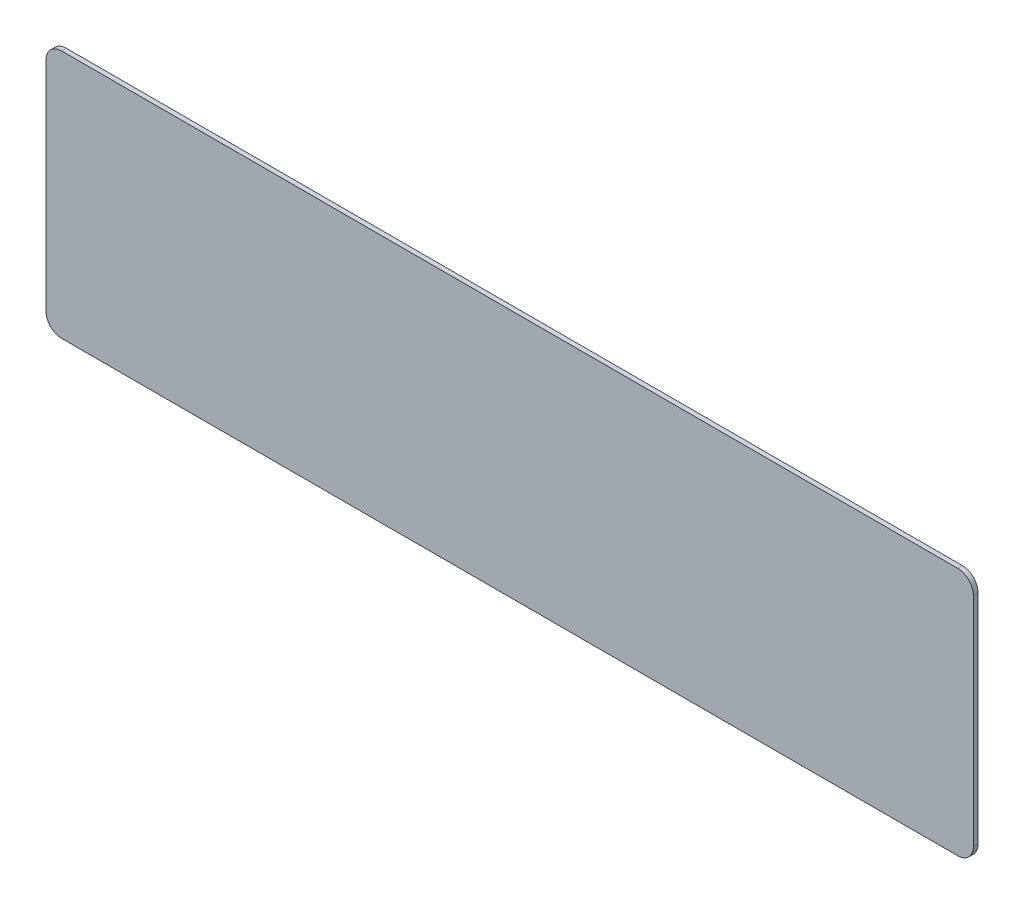
ISO-10303-21;
HEADER;
FILE_DESCRIPTION(('STEP AP214'),'2;1');
FILE_NAME('part.step','',(''),(''),'','','');
FILE_SCHEMA(('AUTOMOTIVE_DESIGN { 1 0 10303 214 1 1 1 1 }'));
ENDSEC;
DATA;
#1=APPLICATION_CONTEXT('core data for automotive mechanical design processes');
#2=APPLICATION_PROTOCOL_DEFINITION('international standard','automotive_design',2000,#1);
#3=PRODUCT_CONTEXT('',#1,'mechanical');
#4=PRODUCT('Part','Part','',(#3));
#5=PRODUCT_RELATED_PRODUCT_CATEGORY('part','',(#4));
#6=PRODUCT_DEFINITION_FORMATION('','',#4);
#7=PRODUCT_DEFINITION_CONTEXT('part definition',#1,'design');
#8=PRODUCT_DEFINITION('design','',#6,#7);
#9=PRODUCT_DEFINITION_SHAPE('','',#8);
#10=(LENGTH_UNIT() NAMED_UNIT(*) SI_UNIT(.MILLI.,.METRE.));
#11=(NAMED_UNIT(*) PLANE_ANGLE_UNIT() SI_UNIT($,.RADIAN.));
#12=(NAMED_UNIT(*) SI_UNIT($,.STERADIAN.) SOLID_ANGLE_UNIT());
#13=UNCERTAINTY_MEASURE_WITH_UNIT(LENGTH_MEASURE(1.E-05),#10,'distance_accuracy_value','');
#14=(GEOMETRIC_REPRESENTATION_CONTEXT(3) GLOBAL_UNCERTAINTY_ASSIGNED_CONTEXT((#13)) GLOBAL_UNIT_ASSIGNED_CONTEXT((#10,
#11,#12)) REPRESENTATION_CONTEXT('',''));
#15=CARTESIAN_POINT('',(0.,0.,0.));
#16=DIRECTION('',(0.,0.,1.));
#17=DIRECTION('',(1.,0.,0.));
#18=AXIS2_PLACEMENT_3D('',#15,#16,#17);
#19=CARTESIAN_POINT('',(5.,75.,1.5));
#20=DIRECTION('',(0.,0.,-1.));
#21=DIRECTION('',(-1.,0.,0.));
#22=AXIS2_PLACEMENT_3D('',#19,#20,#21);
#23=CYLINDRICAL_SURFACE('',#22,5.);
#24=CARTESIAN_POINT('',(5.,75.,0.));
#25=DIRECTION('',(0.,0.,1.));
#26=DIRECTION('',(1.,0.,0.));
#27=AXIS2_PLACEMENT_3D('',#24,#25,#26);
#28=CIRCLE('',#27,5.);
#29=CARTESIAN_POINT('',(5.00000000000004,80.,0.));
#30=VERTEX_POINT('',#29);
#31=CARTESIAN_POINT('',(0.,75.,0.));
#32=VERTEX_POINT('',#31);
#33=EDGE_CURVE('E129',#30,#32,#28,.T.);
#34=ORIENTED_EDGE('',*,*,#33,.T.);
#35=DIRECTION('',(0.,0.,-1.));
#36=VECTOR('',#35,1.);
#37=CARTESIAN_POINT('',(0.,75.,1.5));
#38=LINE('',#37,#36);
#39=CARTESIAN_POINT('',(0.,75.,1.5));
#40=VERTEX_POINT('',#39);
#41=EDGE_CURVE('E11',#40,#32,#38,.T.);
#42=ORIENTED_EDGE('',*,*,#41,.F.);
#43=CARTESIAN_POINT('',(5.,75.,1.5));
#44=DIRECTION('',(0.,0.,1.));
#45=DIRECTION('',(1.,0.,0.));
#46=AXIS2_PLACEMENT_3D('',#43,#44,#45);
#47=CIRCLE('',#46,5.);
#48=CARTESIAN_POINT('',(5.00000000000004,80.,1.5));
#49=VERTEX_POINT('',#48);
#50=EDGE_CURVE('E143',#49,#40,#47,.T.);
#51=ORIENTED_EDGE('',*,*,#50,.F.);
#52=DIRECTION('',(0.,0.,-1.));
#53=VECTOR('',#52,1.);
#54=CARTESIAN_POINT('',(5.00000000000004,80.,1.5));
#55=LINE('',#54,#53);
#56=EDGE_CURVE('E125',#49,#30,#55,.T.);
#57=ORIENTED_EDGE('',*,*,#56,.T.);
#58=EDGE_LOOP('',(#34,#42,#51,#57));
#59=FACE_BOUND('',#58,.T.);
#60=ADVANCED_FACE('F33',(#59),#23,.T.);
#61=CARTESIAN_POINT('',(0.,5.00000000000004,1.5));
#62=DIRECTION('',(1.,0.,0.));
#63=DIRECTION('',(0.,0.,-1.));
#64=AXIS2_PLACEMENT_3D('',#61,#62,#63);
#65=PLANE('',#64);
#66=DIRECTION('',(0.,-1.,0.));
#67=VECTOR('',#66,1.);
#68=CARTESIAN_POINT('',(0.,5.00000000000004,0.));
#69=LINE('',#68,#67);
#70=CARTESIAN_POINT('',(0.,5.,0.));
#71=VERTEX_POINT('',#70);
#72=EDGE_CURVE('E132',#32,#71,#69,.T.);
#73=ORIENTED_EDGE('',*,*,#72,.T.);
#74=DIRECTION('',(0.,0.,-1.));
#75=VECTOR('',#74,1.);
#76=CARTESIAN_POINT('',(0.,5.,1.5));
#77=LINE('',#76,#75);
#78=CARTESIAN_POINT('',(0.,5.,1.5));
#79=VERTEX_POINT('',#78);
#80=EDGE_CURVE('E41',#79,#71,#77,.T.);
#81=ORIENTED_EDGE('',*,*,#80,.F.);
#82=DIRECTION('',(0.,-1.,0.));
#83=VECTOR('',#82,1.);
#84=CARTESIAN_POINT('',(0.,5.00000000000004,1.5));
#85=LINE('',#84,#83);
#86=EDGE_CURVE('E92',#40,#79,#85,.T.);
#87=ORIENTED_EDGE('',*,*,#86,.F.);
#88=ORIENTED_EDGE('',*,*,#41,.T.);
#89=EDGE_LOOP('',(#73,#81,#87,#88));
#90=FACE_BOUND('',#89,.T.);
#91=ADVANCED_FACE('F178',(#90),#65,.F.);
#92=CARTESIAN_POINT('',(5.,5.,1.5));
#93=DIRECTION('',(0.,0.,-1.));
#94=DIRECTION('',(-1.,0.,0.));
#95=AXIS2_PLACEMENT_3D('',#92,#93,#94);
#96=CYLINDRICAL_SURFACE('',#95,5.);
#97=CARTESIAN_POINT('',(5.,5.,0.));
#98=DIRECTION('',(0.,0.,1.));
#99=DIRECTION('',(-1.,0.,0.));
#100=AXIS2_PLACEMENT_3D('',#97,#98,#99);
#101=CIRCLE('',#100,5.);
#102=CARTESIAN_POINT('',(5.00000000000004,0.,0.));
#103=VERTEX_POINT('',#102);
#104=EDGE_CURVE('E134',#71,#103,#101,.T.);
#105=ORIENTED_EDGE('',*,*,#104,.T.);
#106=DIRECTION('',(0.,0.,-1.));
#107=VECTOR('',#106,1.);
#108=CARTESIAN_POINT('',(5.00000000000004,0.,1.5));
#109=LINE('',#108,#107);
#110=CARTESIAN_POINT('',(5.00000000000004,0.,1.5));
#111=VERTEX_POINT('',#110);
#112=EDGE_CURVE('E150',#111,#103,#109,.T.);
#113=ORIENTED_EDGE('',*,*,#112,.F.);
#114=CARTESIAN_POINT('',(5.,5.,1.5));
#115=DIRECTION('',(0.,0.,1.));
#116=DIRECTION('',(-1.,0.,0.));
#117=AXIS2_PLACEMENT_3D('',#114,#115,#116);
#118=CIRCLE('',#117,5.);
#119=EDGE_CURVE('E158',#79,#111,#118,.T.);
#120=ORIENTED_EDGE('',*,*,#119,.F.);
#121=ORIENTED_EDGE('',*,*,#80,.T.);
#122=EDGE_LOOP('',(#105,#113,#120,#121));
#123=FACE_BOUND('',#122,.T.);
#124=ADVANCED_FACE('F156',(#123),#96,.T.);
#125=CARTESIAN_POINT('',(5.00000000000004,0.,1.5));
#126=DIRECTION('',(0.,1.,0.));
#127=DIRECTION('',(0.,0.,1.));
#128=AXIS2_PLACEMENT_3D('',#125,#126,#127);
#129=PLANE('',#128);
#130=DIRECTION('',(1.,0.,0.));
#131=VECTOR('',#130,1.);
#132=CARTESIAN_POINT('',(5.00000000000004,0.,0.));
#133=LINE('',#132,#131);
#134=CARTESIAN_POINT('',(293.,0.,0.));
#135=VERTEX_POINT('',#134);
#136=EDGE_CURVE('E136',#103,#135,#133,.T.);
#137=ORIENTED_EDGE('',*,*,#136,.T.);
#138=DIRECTION('',(0.,0.,-1.));
#139=VECTOR('',#138,1.);
#140=CARTESIAN_POINT('',(293.,0.,1.5));
#141=LINE('',#140,#139);
#142=CARTESIAN_POINT('',(293.,0.,1.5));
#143=VERTEX_POINT('',#142);
#144=EDGE_CURVE('E147',#143,#135,#141,.T.);
#145=ORIENTED_EDGE('',*,*,#144,.F.);
#146=DIRECTION('',(1.,0.,0.));
#147=VECTOR('',#146,1.);
#148=CARTESIAN_POINT('',(5.00000000000004,0.,1.5));
#149=LINE('',#148,#147);
#150=EDGE_CURVE('E170',#111,#143,#149,.T.);
#151=ORIENTED_EDGE('',*,*,#150,.F.);
#152=ORIENTED_EDGE('',*,*,#112,.T.);
#153=EDGE_LOOP('',(#137,#145,#151,#152));
#154=FACE_BOUND('',#153,.T.);
#155=ADVANCED_FACE('F166',(#154),#129,.F.);
#156=CARTESIAN_POINT('',(293.,5.,1.5));
#157=DIRECTION('',(0.,0.,-1.));
#158=DIRECTION('',(-1.,0.,0.));
#159=AXIS2_PLACEMENT_3D('',#156,#157,#158);
#160=CYLINDRICAL_SURFACE('',#159,5.);
#161=CARTESIAN_POINT('',(293.,5.,0.));
#162=DIRECTION('',(0.,0.,1.));
#163=DIRECTION('',(1.,0.,0.));
#164=AXIS2_PLACEMENT_3D('',#161,#162,#163);
#165=CIRCLE('',#164,5.);
#166=CARTESIAN_POINT('',(298.,5.,0.));
#167=VERTEX_POINT('',#166);
#168=EDGE_CURVE('E138',#135,#167,#165,.T.);
#169=ORIENTED_EDGE('',*,*,#168,.T.);
#170=DIRECTION('',(0.,0.,-1.));
#171=VECTOR('',#170,1.);
#172=CARTESIAN_POINT('',(298.,5.,1.5));
#173=LINE('',#172,#171);
#174=CARTESIAN_POINT('',(298.,5.,1.5));
#175=VERTEX_POINT('',#174);
#176=EDGE_CURVE('E120',#175,#167,#173,.T.);
#177=ORIENTED_EDGE('',*,*,#176,.F.);
#178=CARTESIAN_POINT('',(293.,5.,1.5));
#179=DIRECTION('',(0.,0.,1.));
#180=DIRECTION('',(1.,0.,0.));
#181=AXIS2_PLACEMENT_3D('',#178,#179,#180);
#182=CIRCLE('',#181,5.);
#183=EDGE_CURVE('E111',#143,#175,#182,.T.);
#184=ORIENTED_EDGE('',*,*,#183,.F.);
#185=ORIENTED_EDGE('',*,*,#144,.T.);
#186=EDGE_LOOP('',(#169,#177,#184,#185));
#187=FACE_BOUND('',#186,.T.);
#188=ADVANCED_FACE('F169',(#187),#160,.T.);
#189=CARTESIAN_POINT('',(298.,5.,1.5));
#190=DIRECTION('',(-1.,0.,0.));
#191=DIRECTION('',(0.,0.,1.));
#192=AXIS2_PLACEMENT_3D('',#189,#190,#191);
#193=PLANE('',#192);
#194=DIRECTION('',(0.,1.,0.));
#195=VECTOR('',#194,1.);
#196=CARTESIAN_POINT('',(298.,5.,0.));
#197=LINE('',#196,#195);
#198=CARTESIAN_POINT('',(298.,75.,0.));
#199=VERTEX_POINT('',#198);
#200=EDGE_CURVE('E119',#167,#199,#197,.T.);
#201=ORIENTED_EDGE('',*,*,#200,.T.);
#202=DIRECTION('',(0.,0.,-1.));
#203=VECTOR('',#202,1.);
#204=CARTESIAN_POINT('',(298.,75.,1.5));
#205=LINE('',#204,#203);
#206=CARTESIAN_POINT('',(298.,75.,1.5));
#207=VERTEX_POINT('',#206);
#208=EDGE_CURVE('E116',#207,#199,#205,.T.);
#209=ORIENTED_EDGE('',*,*,#208,.F.);
#210=DIRECTION('',(0.,1.,0.));
#211=VECTOR('',#210,1.);
#212=CARTESIAN_POINT('',(298.,5.,1.5));
#213=LINE('',#212,#211);
#214=EDGE_CURVE('E105',#175,#207,#213,.T.);
#215=ORIENTED_EDGE('',*,*,#214,.F.);
#216=ORIENTED_EDGE('',*,*,#176,.T.);
#217=EDGE_LOOP('',(#201,#209,#215,#216));
#218=FACE_BOUND('',#217,.T.);
#219=ADVANCED_FACE('F117',(#218),#193,.F.);
#220=CARTESIAN_POINT('',(293.,75.,1.5));
#221=DIRECTION('',(0.,0.,-1.));
#222=DIRECTION('',(-1.,0.,0.));
#223=AXIS2_PLACEMENT_3D('',#220,#221,#222);
#224=CYLINDRICAL_SURFACE('',#223,5.);
#225=CARTESIAN_POINT('',(293.,75.,0.));
#226=DIRECTION('',(0.,0.,1.));
#227=DIRECTION('',(1.,0.,0.));
#228=AXIS2_PLACEMENT_3D('',#225,#226,#227);
#229=CIRCLE('',#228,5.);
#230=CARTESIAN_POINT('',(293.,80.,0.));
#231=VERTEX_POINT('',#230);
#232=EDGE_CURVE('E78',#199,#231,#229,.T.);
#233=ORIENTED_EDGE('',*,*,#232,.T.);
#234=DIRECTION('',(0.,0.,-1.));
#235=VECTOR('',#234,1.);
#236=CARTESIAN_POINT('',(293.,80.,1.5));
#237=LINE('',#236,#235);
#238=CARTESIAN_POINT('',(293.,80.,1.5));
#239=VERTEX_POINT('',#238);
#240=EDGE_CURVE('E121',#239,#231,#237,.T.);
#241=ORIENTED_EDGE('',*,*,#240,.F.);
#242=CARTESIAN_POINT('',(293.,75.,1.5));
#243=DIRECTION('',(0.,0.,1.));
#244=DIRECTION('',(1.,0.,0.));
#245=AXIS2_PLACEMENT_3D('',#242,#243,#244);
#246=CIRCLE('',#245,5.);
#247=EDGE_CURVE('E109',#207,#239,#246,.T.);
#248=ORIENTED_EDGE('',*,*,#247,.F.);
#249=ORIENTED_EDGE('',*,*,#208,.T.);
#250=EDGE_LOOP('',(#233,#241,#248,#249));
#251=FACE_BOUND('',#250,.T.);
#252=ADVANCED_FACE('F123',(#251),#224,.T.);
#253=CARTESIAN_POINT('',(5.00000000000004,80.,1.5));
#254=DIRECTION('',(0.,-1.,0.));
#255=DIRECTION('',(0.,0.,-1.));
#256=AXIS2_PLACEMENT_3D('',#253,#254,#255);
#257=PLANE('',#256);
#258=DIRECTION('',(-1.,0.,0.));
#259=VECTOR('',#258,1.);
#260=CARTESIAN_POINT('',(5.00000000000004,80.,0.));
#261=LINE('',#260,#259);
#262=EDGE_CURVE('E84',#231,#30,#261,.T.);
#263=ORIENTED_EDGE('',*,*,#262,.T.);
#264=ORIENTED_EDGE('',*,*,#56,.F.);
#265=DIRECTION('',(-1.,0.,0.));
#266=VECTOR('',#265,1.);
#267=CARTESIAN_POINT('',(5.00000000000004,80.,1.5));
#268=LINE('',#267,#266);
#269=EDGE_CURVE('E49',#239,#49,#268,.T.);
#270=ORIENTED_EDGE('',*,*,#269,.F.);
#271=ORIENTED_EDGE('',*,*,#240,.T.);
#272=EDGE_LOOP('',(#263,#264,#270,#271));
#273=FACE_BOUND('',#272,.T.);
#274=ADVANCED_FACE('F194',(#273),#257,.F.);
#275=CARTESIAN_POINT('',(5.,75.,1.5));
#276=DIRECTION('',(0.,0.,1.));
#277=DIRECTION('',(1.,0.,0.));
#278=AXIS2_PLACEMENT_3D('',#275,#276,#277);
#279=PLANE('',#278);
#280=ORIENTED_EDGE('',*,*,#50,.T.);
#281=ORIENTED_EDGE('',*,*,#86,.T.);
#282=ORIENTED_EDGE('',*,*,#119,.T.);
#283=ORIENTED_EDGE('',*,*,#150,.T.);
#284=ORIENTED_EDGE('',*,*,#183,.T.);
#285=ORIENTED_EDGE('',*,*,#214,.T.);
#286=ORIENTED_EDGE('',*,*,#247,.T.);
#287=ORIENTED_EDGE('',*,*,#269,.T.);
#288=EDGE_LOOP('',(#280,#281,#282,#283,#284,#285,#286,#287));
#289=FACE_BOUND('',#288,.T.);
#290=ADVANCED_FACE('F107',(#289),#279,.T.);
#291=CARTESIAN_POINT('',(5.,75.,0.));
#292=DIRECTION('',(0.,0.,1.));
#293=DIRECTION('',(1.,0.,0.));
#294=AXIS2_PLACEMENT_3D('',#291,#292,#293);
#295=PLANE('',#294);
#296=ORIENTED_EDGE('',*,*,#33,.F.);
#297=ORIENTED_EDGE('',*,*,#262,.F.);
#298=ORIENTED_EDGE('',*,*,#232,.F.);
#299=ORIENTED_EDGE('',*,*,#200,.F.);
#300=ORIENTED_EDGE('',*,*,#168,.F.);
#301=ORIENTED_EDGE('',*,*,#136,.F.);
#302=ORIENTED_EDGE('',*,*,#104,.F.);
#303=ORIENTED_EDGE('',*,*,#72,.F.);
#304=EDGE_LOOP('',(#296,#297,#298,#299,#300,#301,#302,#303));
#305=FACE_BOUND('',#304,.T.);
#306=ADVANCED_FACE('F162',(#305),#295,.F.);
#307=CLOSED_SHELL('',(#60,#91,#124,#155,#188,#219,#252,#274,#290,#306));
#308=MANIFOLD_SOLID_BREP('B2',#307);
#309=ADVANCED_BREP_SHAPE_REPRESENTATION('',(#18,#308),#14);
#310=SHAPE_DEFINITION_REPRESENTATION(#9,#309);
ENDSEC;
END-ISO-10303-21;
